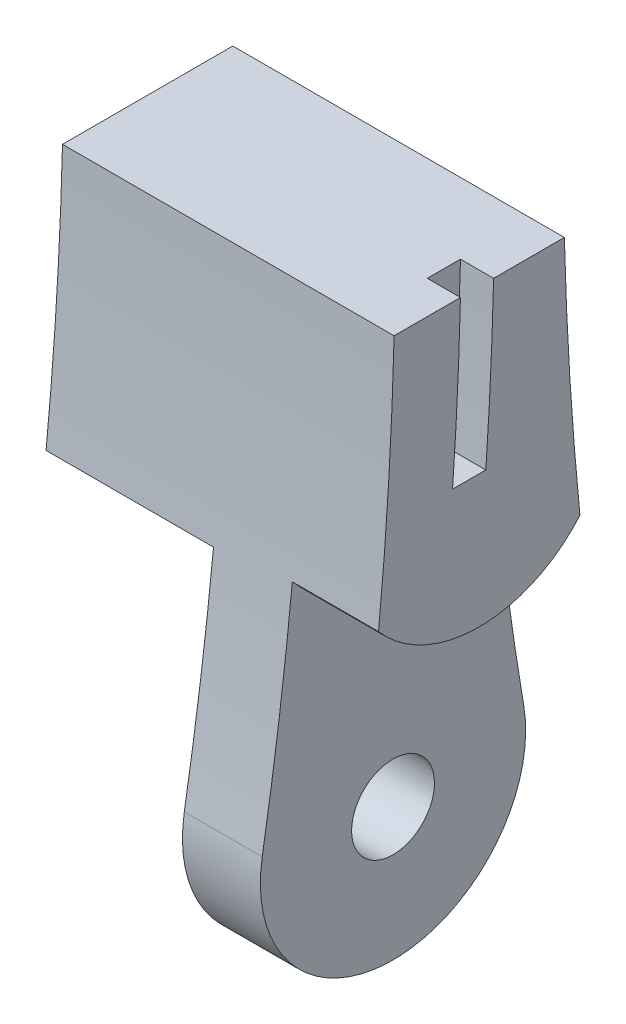
ISO-10303-21;
HEADER;
FILE_DESCRIPTION(('STEP AP214'),'2;1');
FILE_NAME('part.step','',(''),(''),'','','');
FILE_SCHEMA(('AUTOMOTIVE_DESIGN { 1 0 10303 214 1 1 1 1 }'));
ENDSEC;
DATA;
#1=APPLICATION_CONTEXT('core data for automotive mechanical design processes');
#2=APPLICATION_PROTOCOL_DEFINITION('international standard','automotive_design',2000,#1);
#3=PRODUCT_CONTEXT('',#1,'mechanical');
#4=PRODUCT('Part','Part','',(#3));
#5=PRODUCT_RELATED_PRODUCT_CATEGORY('part','',(#4));
#6=PRODUCT_DEFINITION_FORMATION('','',#4);
#7=PRODUCT_DEFINITION_CONTEXT('part definition',#1,'design');
#8=PRODUCT_DEFINITION('design','',#6,#7);
#9=PRODUCT_DEFINITION_SHAPE('','',#8);
#10=(LENGTH_UNIT() NAMED_UNIT(*) SI_UNIT(.MILLI.,.METRE.));
#11=(NAMED_UNIT(*) PLANE_ANGLE_UNIT() SI_UNIT($,.RADIAN.));
#12=(NAMED_UNIT(*) SI_UNIT($,.STERADIAN.) SOLID_ANGLE_UNIT());
#13=UNCERTAINTY_MEASURE_WITH_UNIT(LENGTH_MEASURE(1.E-05),#10,'distance_accuracy_value','');
#14=(GEOMETRIC_REPRESENTATION_CONTEXT(3) GLOBAL_UNCERTAINTY_ASSIGNED_CONTEXT((#13)) GLOBAL_UNIT_ASSIGNED_CONTEXT((#10,
#11,#12)) REPRESENTATION_CONTEXT('',''));
#15=CARTESIAN_POINT('',(0.,0.,0.));
#16=DIRECTION('',(0.,0.,1.));
#17=DIRECTION('',(1.,0.,0.));
#18=AXIS2_PLACEMENT_3D('',#15,#16,#17);
#19=CARTESIAN_POINT('',(20.,-57.7298826777088,0.));
#20=DIRECTION('',(-1.,0.,0.));
#21=DIRECTION('',(0.,0.,1.));
#22=AXIS2_PLACEMENT_3D('',#19,#20,#21);
#23=CYLINDRICAL_SURFACE('',#22,2.5);
#24=CARTESIAN_POINT('',(8.1,-57.7298826777088,0.));
#25=DIRECTION('',(-1.,0.,0.));
#26=DIRECTION('',(0.,0.,1.));
#27=AXIS2_PLACEMENT_3D('',#24,#25,#26);
#28=CIRCLE('',#27,2.5);
#29=CARTESIAN_POINT('',(8.1,-57.7298826777088,2.5));
#30=VERTEX_POINT('',#29);
#31=EDGE_CURVE('E189',#30,#30,#28,.T.);
#32=ORIENTED_EDGE('',*,*,#31,.T.);
#33=EDGE_LOOP('',(#32));
#34=FACE_BOUND('',#33,.T.);
#35=CARTESIAN_POINT('',(14.8,-57.7298826777088,0.));
#36=DIRECTION('',(1.,0.,0.));
#37=DIRECTION('',(0.,0.,-1.));
#38=AXIS2_PLACEMENT_3D('',#35,#36,#37);
#39=CIRCLE('',#38,2.5);
#40=CARTESIAN_POINT('',(14.8,-57.7298826777088,-2.5));
#41=VERTEX_POINT('',#40);
#42=EDGE_CURVE('E199',#41,#41,#39,.T.);
#43=ORIENTED_EDGE('',*,*,#42,.T.);
#44=EDGE_LOOP('',(#43));
#45=FACE_BOUND('',#44,.T.);
#46=ADVANCED_FACE('F34',(#34,#45),#23,.F.);
#47=CARTESIAN_POINT('',(-40.6180069084204,-57.7298826777088,0.));
#48=DIRECTION('',(1.,0.,0.));
#49=DIRECTION('',(0.,0.,-1.));
#50=AXIS2_PLACEMENT_3D('',#47,#48,#49);
#51=CYLINDRICAL_SURFACE('',#50,5.15);
#52=DIRECTION('',(1.,0.,0.));
#53=VECTOR('',#52,1.);
#54=CARTESIAN_POINT('',(-40.6180069084204,-53.2273833717677,-2.5));
#55=LINE('',#54,#53);
#56=CARTESIAN_POINT('',(8.1,-53.2273833717677,-2.5));
#57=VERTEX_POINT('',#56);
#58=CARTESIAN_POINT('',(10.1,-53.2273833717677,-2.5));
#59=VERTEX_POINT('',#58);
#60=EDGE_CURVE('E249',#57,#59,#55,.T.);
#61=ORIENTED_EDGE('',*,*,#60,.T.);
#62=CARTESIAN_POINT('',(10.1,-57.7298826777088,0.));
#63=DIRECTION('',(1.,0.,0.));
#64=DIRECTION('',(0.,0.,1.));
#65=AXIS2_PLACEMENT_3D('',#62,#63,#64);
#66=CIRCLE('',#65,5.15);
#67=CARTESIAN_POINT('',(10.1,-53.2273833717677,2.5));
#68=VERTEX_POINT('',#67);
#69=EDGE_CURVE('E274',#68,#59,#66,.T.);
#70=ORIENTED_EDGE('',*,*,#69,.F.);
#71=DIRECTION('',(1.,0.,0.));
#72=VECTOR('',#71,1.);
#73=CARTESIAN_POINT('',(-40.6180069084204,-53.2273833717677,2.5));
#74=LINE('',#73,#72);
#75=CARTESIAN_POINT('',(8.1,-53.2273833717677,2.5));
#76=VERTEX_POINT('',#75);
#77=EDGE_CURVE('E252',#76,#68,#74,.T.);
#78=ORIENTED_EDGE('',*,*,#77,.F.);
#79=CARTESIAN_POINT('',(8.1,-57.7298826777088,0.));
#80=DIRECTION('',(-1.,0.,0.));
#81=DIRECTION('',(0.,0.,1.));
#82=AXIS2_PLACEMENT_3D('',#79,#80,#81);
#83=CIRCLE('',#82,5.15);
#84=EDGE_CURVE('E206',#57,#76,#83,.T.);
#85=ORIENTED_EDGE('',*,*,#84,.F.);
#86=EDGE_LOOP('',(#61,#70,#78,#85));
#87=FACE_BOUND('',#86,.T.);
#88=ADVANCED_FACE('F329',(#87),#51,.T.);
#89=CARTESIAN_POINT('',(-40.6180069084204,-53.2273833717677,2.5));
#90=DIRECTION('',(0.,0.,1.));
#91=DIRECTION('',(0.,-1.,0.));
#92=AXIS2_PLACEMENT_3D('',#89,#90,#91);
#93=PLANE('',#92);
#94=ORIENTED_EDGE('',*,*,#77,.T.);
#95=DIRECTION('',(0.,-1.,0.));
#96=VECTOR('',#95,1.);
#97=CARTESIAN_POINT('',(10.1,-53.2273833717677,2.5));
#98=LINE('',#97,#96);
#99=CARTESIAN_POINT('',(10.1,-45.7298826777088,2.5));
#100=VERTEX_POINT('',#99);
#101=EDGE_CURVE('E277',#100,#68,#98,.T.);
#102=ORIENTED_EDGE('',*,*,#101,.F.);
#103=DIRECTION('',(1.,0.,0.));
#104=VECTOR('',#103,1.);
#105=CARTESIAN_POINT('',(-40.6180069084204,-45.7298826777088,2.5));
#106=LINE('',#105,#104);
#107=CARTESIAN_POINT('',(8.1,-45.7298826777088,2.5));
#108=VERTEX_POINT('',#107);
#109=EDGE_CURVE('E260',#108,#100,#106,.T.);
#110=ORIENTED_EDGE('',*,*,#109,.F.);
#111=DIRECTION('',(0.,1.,0.));
#112=VECTOR('',#111,1.);
#113=CARTESIAN_POINT('',(8.1,-65.7298826777088,2.5));
#114=LINE('',#113,#112);
#115=EDGE_CURVE('E196',#76,#108,#114,.T.);
#116=ORIENTED_EDGE('',*,*,#115,.F.);
#117=EDGE_LOOP('',(#94,#102,#110,#116));
#118=FACE_BOUND('',#117,.T.);
#119=ADVANCED_FACE('F333',(#118),#93,.T.);
#120=CARTESIAN_POINT('',(8.1,-65.7298826777088,20.));
#121=DIRECTION('',(-1.,0.,0.));
#122=DIRECTION('',(0.,0.,1.));
#123=AXIS2_PLACEMENT_3D('',#120,#121,#122);
#124=PLANE('',#123);
#125=ORIENTED_EDGE('',*,*,#31,.F.);
#126=EDGE_LOOP('',(#125));
#127=FACE_BOUND('',#126,.T.);
#128=DIRECTION('',(0.,0.,-1.));
#129=VECTOR('',#128,1.);
#130=CARTESIAN_POINT('',(8.1,-45.7298826777088,20.));
#131=LINE('',#130,#129);
#132=CARTESIAN_POINT('',(8.1,-45.7298826777088,-2.5));
#133=VERTEX_POINT('',#132);
#134=EDGE_CURVE('E186',#108,#133,#131,.T.);
#135=ORIENTED_EDGE('',*,*,#134,.T.);
#136=DIRECTION('',(0.,-1.,0.));
#137=VECTOR('',#136,1.);
#138=CARTESIAN_POINT('',(8.1,-65.7298826777088,-2.5));
#139=LINE('',#138,#137);
#140=EDGE_CURVE('E209',#133,#57,#139,.T.);
#141=ORIENTED_EDGE('',*,*,#140,.T.);
#142=ORIENTED_EDGE('',*,*,#84,.T.);
#143=ORIENTED_EDGE('',*,*,#115,.T.);
#144=EDGE_LOOP('',(#135,#141,#142,#143));
#145=FACE_BOUND('',#144,.T.);
#146=ADVANCED_FACE('F243',(#127,#145),#124,.T.);
#147=CARTESIAN_POINT('',(-40.6180069084204,-53.2273833717677,-2.5));
#148=DIRECTION('',(0.,0.,-1.));
#149=DIRECTION('',(0.,1.,0.));
#150=AXIS2_PLACEMENT_3D('',#147,#148,#149);
#151=PLANE('',#150);
#152=DIRECTION('',(1.,0.,0.));
#153=VECTOR('',#152,1.);
#154=CARTESIAN_POINT('',(-40.6180069084204,-45.7298826777088,-2.5));
#155=LINE('',#154,#153);
#156=CARTESIAN_POINT('',(10.1,-45.7298826777088,-2.5));
#157=VERTEX_POINT('',#156);
#158=EDGE_CURVE('E250',#133,#157,#155,.T.);
#159=ORIENTED_EDGE('',*,*,#158,.T.);
#160=DIRECTION('',(0.,1.,0.));
#161=VECTOR('',#160,1.);
#162=CARTESIAN_POINT('',(10.1,-53.2273833717677,-2.5));
#163=LINE('',#162,#161);
#164=EDGE_CURVE('E254',#59,#157,#163,.T.);
#165=ORIENTED_EDGE('',*,*,#164,.F.);
#166=ORIENTED_EDGE('',*,*,#60,.F.);
#167=ORIENTED_EDGE('',*,*,#140,.F.);
#168=EDGE_LOOP('',(#159,#165,#166,#167));
#169=FACE_BOUND('',#168,.T.);
#170=ADVANCED_FACE('F327',(#169),#151,.T.);
#171=CARTESIAN_POINT('',(-10.4655300205067,-37.7298826777088,0.));
#172=DIRECTION('',(1.,0.,0.));
#173=DIRECTION('',(0.,0.,-1.));
#174=AXIS2_PLACEMENT_3D('',#171,#172,#173);
#175=CYLINDRICAL_SURFACE('',#174,7.99999999999999);
#176=CARTESIAN_POINT('',(14.8,-37.7298826777088,0.));
#177=DIRECTION('',(1.,0.,0.));
#178=DIRECTION('',(0.,0.,-1.));
#179=AXIS2_PLACEMENT_3D('',#176,#177,#178);
#180=CIRCLE('',#179,7.99999999999999);
#181=CARTESIAN_POINT('',(14.8,-42.9372483872719,6.07316576151726));
#182=VERTEX_POINT('',#181);
#183=CARTESIAN_POINT('',(14.8,-42.9372483872719,-6.07316576151726));
#184=VERTEX_POINT('',#183);
#185=EDGE_CURVE('E307',#182,#184,#180,.T.);
#186=ORIENTED_EDGE('',*,*,#185,.T.);
#187=DIRECTION('',(1.,0.,0.));
#188=VECTOR('',#187,1.);
#189=CARTESIAN_POINT('',(17.4,-42.9372483872721,-6.0731657615171));
#190=LINE('',#189,#188);
#191=CARTESIAN_POINT('',(20.,-42.9372483872721,-6.0731657615171));
#192=VERTEX_POINT('',#191);
#193=EDGE_CURVE('E304',#192,#184,#190,.F.);
#194=ORIENTED_EDGE('',*,*,#193,.F.);
#195=CARTESIAN_POINT('',(20.,-37.7298826777088,0.));
#196=DIRECTION('',(-1.,0.,0.));
#197=DIRECTION('',(0.,0.,-1.));
#198=AXIS2_PLACEMENT_3D('',#195,#196,#197);
#199=CIRCLE('',#198,7.99999999999999);
#200=CARTESIAN_POINT('',(20.,-42.9372483872721,6.0731657615171));
#201=VERTEX_POINT('',#200);
#202=EDGE_CURVE('E308',#192,#201,#199,.T.);
#203=ORIENTED_EDGE('',*,*,#202,.T.);
#204=DIRECTION('',(1.,0.,0.));
#205=VECTOR('',#204,1.);
#206=CARTESIAN_POINT('',(17.4,-42.9372483872721,6.0731657615171));
#207=LINE('',#206,#205);
#208=EDGE_CURVE('E175',#182,#201,#207,.T.);
#209=ORIENTED_EDGE('',*,*,#208,.F.);
#210=EDGE_LOOP('',(#186,#194,#203,#209));
#211=FACE_BOUND('',#210,.T.);
#212=ADVANCED_FACE('F365',(#211),#175,.T.);
#213=CARTESIAN_POINT('',(14.8,-65.7298826777088,20.));
#214=DIRECTION('',(1.,0.,0.));
#215=DIRECTION('',(0.,0.,-1.));
#216=AXIS2_PLACEMENT_3D('',#213,#214,#215);
#217=PLANE('',#216);
#218=CARTESIAN_POINT('',(14.8,-22.9548826777087,-205.072424706492));
#219=DIRECTION('',(1.,0.,0.));
#220=DIRECTION('',(0.,0.,-1.));
#221=AXIS2_PLACEMENT_3D('',#218,#219,#220);
#222=CIRCLE('',#221,200.);
#223=CARTESIAN_POINT('',(14.8,-56.3923826777087,-7.8874009502497));
#224=VERTEX_POINT('',#223);
#225=EDGE_CURVE('E202',#224,#184,#222,.F.);
#226=ORIENTED_EDGE('',*,*,#225,.T.);
#227=ORIENTED_EDGE('',*,*,#185,.F.);
#228=CARTESIAN_POINT('',(14.8,-22.9548826777087,205.072424706492));
#229=DIRECTION('',(1.,0.,0.));
#230=DIRECTION('',(0.,0.,-1.));
#231=AXIS2_PLACEMENT_3D('',#228,#229,#230);
#232=CIRCLE('',#231,200.);
#233=CARTESIAN_POINT('',(14.8,-56.3923826777088,7.88740095024971));
#234=VERTEX_POINT('',#233);
#235=EDGE_CURVE('E231',#182,#234,#232,.F.);
#236=ORIENTED_EDGE('',*,*,#235,.T.);
#237=CARTESIAN_POINT('',(14.8,-57.7298826777088,0.));
#238=DIRECTION('',(1.,0.,0.));
#239=DIRECTION('',(0.,0.,-1.));
#240=AXIS2_PLACEMENT_3D('',#237,#238,#239);
#241=CIRCLE('',#240,8.);
#242=EDGE_CURVE('E228',#234,#224,#241,.T.);
#243=ORIENTED_EDGE('',*,*,#242,.T.);
#244=EDGE_LOOP('',(#226,#227,#236,#243));
#245=FACE_BOUND('',#244,.T.);
#246=ORIENTED_EDGE('',*,*,#42,.F.);
#247=EDGE_LOOP('',(#246));
#248=FACE_BOUND('',#247,.T.);
#249=ADVANCED_FACE('F359',(#245,#248),#217,.T.);
#250=CARTESIAN_POINT('',(20.,-57.7298826777088,0.));
#251=DIRECTION('',(-1.,0.,0.));
#252=DIRECTION('',(0.,0.,1.));
#253=AXIS2_PLACEMENT_3D('',#250,#251,#252);
#254=CYLINDRICAL_SURFACE('',#253,8.);
#255=CARTESIAN_POINT('',(10.1,-57.7298826777088,0.));
#256=DIRECTION('',(-1.,0.,0.));
#257=DIRECTION('',(0.,0.,1.));
#258=AXIS2_PLACEMENT_3D('',#255,#256,#257);
#259=CIRCLE('',#258,8.);
#260=CARTESIAN_POINT('',(10.1,-56.3923826777087,-7.8874009502497));
#261=VERTEX_POINT('',#260);
#262=CARTESIAN_POINT('',(10.1,-56.3923826777088,7.88740095024971));
#263=VERTEX_POINT('',#262);
#264=EDGE_CURVE('E42',#261,#263,#259,.T.);
#265=ORIENTED_EDGE('',*,*,#264,.F.);
#266=DIRECTION('',(-1.,0.,0.));
#267=VECTOR('',#266,1.);
#268=CARTESIAN_POINT('',(20.,-56.3923826777087,-7.8874009502497));
#269=LINE('',#268,#267);
#270=EDGE_CURVE('E180',#224,#261,#269,.T.);
#271=ORIENTED_EDGE('',*,*,#270,.F.);
#272=ORIENTED_EDGE('',*,*,#242,.F.);
#273=DIRECTION('',(-1.,0.,0.));
#274=VECTOR('',#273,1.);
#275=CARTESIAN_POINT('',(20.,-56.3923826777088,7.88740095024971));
#276=LINE('',#275,#274);
#277=EDGE_CURVE('E193',#234,#263,#276,.T.);
#278=ORIENTED_EDGE('',*,*,#277,.T.);
#279=EDGE_LOOP('',(#265,#271,#272,#278));
#280=FACE_BOUND('',#279,.T.);
#281=ADVANCED_FACE('F227',(#280),#254,.T.);
#282=CARTESIAN_POINT('',(10.1,-37.7298826777088,0.));
#283=DIRECTION('',(-1.,0.,0.));
#284=DIRECTION('',(0.,0.,1.));
#285=AXIS2_PLACEMENT_3D('',#282,#283,#284);
#286=PLANE('',#285);
#287=CARTESIAN_POINT('',(10.1,-22.9548826777087,205.072424706492));
#288=DIRECTION('',(-1.,0.,0.));
#289=DIRECTION('',(0.,0.,1.));
#290=AXIS2_PLACEMENT_3D('',#287,#288,#289);
#291=CIRCLE('',#290,200.);
#292=CARTESIAN_POINT('',(10.1,-43.4508425723786,6.12540756877284));
#293=VERTEX_POINT('',#292);
#294=EDGE_CURVE('E203',#263,#293,#291,.F.);
#295=ORIENTED_EDGE('',*,*,#294,.T.);
#296=CARTESIAN_POINT('',(10.1,-37.7298826777088,0.));
#297=DIRECTION('',(1.,0.,0.));
#298=DIRECTION('',(0.,0.,1.));
#299=AXIS2_PLACEMENT_3D('',#296,#297,#298);
#300=CIRCLE('',#299,8.3815273071201);
#301=EDGE_CURVE('E268',#293,#100,#300,.T.);
#302=ORIENTED_EDGE('',*,*,#301,.T.);
#303=ORIENTED_EDGE('',*,*,#101,.T.);
#304=ORIENTED_EDGE('',*,*,#69,.T.);
#305=ORIENTED_EDGE('',*,*,#164,.T.);
#306=CARTESIAN_POINT('',(10.1,-37.7298826777088,0.));
#307=DIRECTION('',(1.,0.,0.));
#308=DIRECTION('',(0.,0.,1.));
#309=AXIS2_PLACEMENT_3D('',#306,#307,#308);
#310=CIRCLE('',#309,8.3815273071201);
#311=CARTESIAN_POINT('',(10.1,-43.4508425723786,-6.12540756877284));
#312=VERTEX_POINT('',#311);
#313=EDGE_CURVE('E281',#157,#312,#310,.T.);
#314=ORIENTED_EDGE('',*,*,#313,.T.);
#315=CARTESIAN_POINT('',(10.1,-22.9548826777087,-205.072424706492));
#316=DIRECTION('',(-1.,0.,0.));
#317=DIRECTION('',(0.,0.,1.));
#318=AXIS2_PLACEMENT_3D('',#315,#316,#317);
#319=CIRCLE('',#318,200.);
#320=EDGE_CURVE('E218',#312,#261,#319,.F.);
#321=ORIENTED_EDGE('',*,*,#320,.T.);
#322=ORIENTED_EDGE('',*,*,#264,.T.);
#323=EDGE_LOOP('',(#295,#302,#303,#304,#305,#314,#321,#322));
#324=FACE_BOUND('',#323,.T.);
#325=ADVANCED_FACE('F214',(#324),#286,.T.);
#326=CARTESIAN_POINT('',(-40.6180069084204,-37.7298826777088,0.));
#327=DIRECTION('',(1.,0.,0.));
#328=DIRECTION('',(0.,0.,-1.));
#329=AXIS2_PLACEMENT_3D('',#326,#327,#328);
#330=CYLINDRICAL_SURFACE('',#329,8.3815273071201);
#331=DIRECTION('',(1.,0.,0.));
#332=VECTOR('',#331,1.);
#333=CARTESIAN_POINT('',(5.05,-43.4508425723783,6.12540756877311));
#334=LINE('',#333,#332);
#335=CARTESIAN_POINT('',(0.,-43.4508425723783,6.12540756877311));
#336=VERTEX_POINT('',#335);
#337=EDGE_CURVE('E224',#293,#336,#334,.F.);
#338=ORIENTED_EDGE('',*,*,#337,.T.);
#339=CARTESIAN_POINT('',(0.,-37.7298826777088,0.));
#340=DIRECTION('',(1.,0.,0.));
#341=DIRECTION('',(0.,0.,-1.));
#342=AXIS2_PLACEMENT_3D('',#339,#340,#341);
#343=CIRCLE('',#342,8.3815273071201);
#344=CARTESIAN_POINT('',(0.,-45.7298826777088,2.5));
#345=VERTEX_POINT('',#344);
#346=EDGE_CURVE('E262',#345,#336,#343,.F.);
#347=ORIENTED_EDGE('',*,*,#346,.F.);
#348=EDGE_CURVE('E56',#345,#108,#106,.T.);
#349=ORIENTED_EDGE('',*,*,#348,.T.);
#350=ORIENTED_EDGE('',*,*,#109,.T.);
#351=ORIENTED_EDGE('',*,*,#301,.F.);
#352=EDGE_LOOP('',(#338,#347,#349,#350,#351));
#353=FACE_BOUND('',#352,.T.);
#354=ADVANCED_FACE('F267',(#353),#330,.T.);
#355=CARTESIAN_POINT('',(0.,-45.7298826777088,20.));
#356=DIRECTION('',(0.,-1.,0.));
#357=DIRECTION('',(0.,0.,-1.));
#358=AXIS2_PLACEMENT_3D('',#355,#356,#357);
#359=PLANE('',#358);
#360=ORIENTED_EDGE('',*,*,#134,.F.);
#361=ORIENTED_EDGE('',*,*,#348,.F.);
#362=DIRECTION('',(0.,0.,-1.));
#363=VECTOR('',#362,1.);
#364=CARTESIAN_POINT('',(0.,-45.7298826777088,20.));
#365=LINE('',#364,#363);
#366=CARTESIAN_POINT('',(0.,-45.7298826777088,-2.5));
#367=VERTEX_POINT('',#366);
#368=EDGE_CURVE('E233',#345,#367,#365,.T.);
#369=ORIENTED_EDGE('',*,*,#368,.T.);
#370=EDGE_CURVE('E245',#367,#133,#155,.T.);
#371=ORIENTED_EDGE('',*,*,#370,.T.);
#372=EDGE_LOOP('',(#360,#361,#369,#371));
#373=FACE_BOUND('',#372,.T.);
#374=ADVANCED_FACE('F244',(#373),#359,.T.);
#375=CARTESIAN_POINT('',(-40.6180069084204,-37.7298826777088,0.));
#376=DIRECTION('',(1.,0.,0.));
#377=DIRECTION('',(0.,0.,-1.));
#378=AXIS2_PLACEMENT_3D('',#375,#376,#377);
#379=CYLINDRICAL_SURFACE('',#378,8.3815273071201);
#380=DIRECTION('',(1.,0.,0.));
#381=VECTOR('',#380,1.);
#382=CARTESIAN_POINT('',(5.05,-43.4508425723783,-6.1254075687731));
#383=LINE('',#382,#381);
#384=CARTESIAN_POINT('',(0.,-43.4508425723783,-6.1254075687731));
#385=VERTEX_POINT('',#384);
#386=EDGE_CURVE('E263',#385,#312,#383,.T.);
#387=ORIENTED_EDGE('',*,*,#386,.T.);
#388=ORIENTED_EDGE('',*,*,#313,.F.);
#389=ORIENTED_EDGE('',*,*,#158,.F.);
#390=ORIENTED_EDGE('',*,*,#370,.F.);
#391=CARTESIAN_POINT('',(0.,-37.7298826777088,0.));
#392=DIRECTION('',(1.,0.,0.));
#393=DIRECTION('',(0.,0.,-1.));
#394=AXIS2_PLACEMENT_3D('',#391,#392,#393);
#395=CIRCLE('',#394,8.3815273071201);
#396=EDGE_CURVE('E256',#385,#367,#395,.F.);
#397=ORIENTED_EDGE('',*,*,#396,.F.);
#398=EDGE_LOOP('',(#387,#388,#389,#390,#397));
#399=FACE_BOUND('',#398,.T.);
#400=ADVANCED_FACE('F322',(#399),#379,.T.);
#401=CARTESIAN_POINT('',(18.,-37.7299537414532,1.608183929246));
#402=DIRECTION('',(0.,-1.,0.));
#403=DIRECTION('',(0.,0.,-1.));
#404=AXIS2_PLACEMENT_3D('',#401,#402,#403);
#405=PLANE('',#404);
#406=DIRECTION('',(0.,0.,-1.));
#407=VECTOR('',#406,1.);
#408=CARTESIAN_POINT('',(20.,-37.7299537414532,1.608183929246));
#409=LINE('',#408,#407);
#410=CARTESIAN_POINT('',(20.,-37.7299537414532,1.608183929246));
#411=VERTEX_POINT('',#410);
#412=CARTESIAN_POINT('',(20.,-37.7299537414532,-0.397031113737234));
#413=VERTEX_POINT('',#412);
#414=EDGE_CURVE('E293',#411,#413,#409,.T.);
#415=ORIENTED_EDGE('',*,*,#414,.T.);
#416=DIRECTION('',(1.,0.,0.));
#417=VECTOR('',#416,1.);
#418=CARTESIAN_POINT('',(18.,-37.7299537414532,-0.397031113737234));
#419=LINE('',#418,#417);
#420=CARTESIAN_POINT('',(18.,-37.7299537414532,-0.397031113737234));
#421=VERTEX_POINT('',#420);
#422=EDGE_CURVE('E283',#421,#413,#419,.T.);
#423=ORIENTED_EDGE('',*,*,#422,.F.);
#424=DIRECTION('',(0.,0.,-1.));
#425=VECTOR('',#424,1.);
#426=CARTESIAN_POINT('',(18.,-37.7299537414532,1.608183929246));
#427=LINE('',#426,#425);
#428=CARTESIAN_POINT('',(18.,-37.7299537414532,1.608183929246));
#429=VERTEX_POINT('',#428);
#430=EDGE_CURVE('E299',#429,#421,#427,.T.);
#431=ORIENTED_EDGE('',*,*,#430,.F.);
#432=DIRECTION('',(1.,0.,0.));
#433=VECTOR('',#432,1.);
#434=CARTESIAN_POINT('',(18.,-37.7299537414532,1.608183929246));
#435=LINE('',#434,#433);
#436=EDGE_CURVE('E284',#429,#411,#435,.T.);
#437=ORIENTED_EDGE('',*,*,#436,.T.);
#438=EDGE_LOOP('',(#415,#423,#431,#437));
#439=FACE_BOUND('',#438,.T.);
#440=ADVANCED_FACE('F379',(#439),#405,.F.);
#441=CARTESIAN_POINT('',(18.,-22.9548826777087,205.072424706492));
#442=DIRECTION('',(1.,0.,0.));
#443=DIRECTION('',(0.,0.,-1.));
#444=AXIS2_PLACEMENT_3D('',#441,#442,#443);
#445=CYLINDRICAL_SURFACE('',#444,206.);
#446=CARTESIAN_POINT('',(20.,-22.9548826777087,205.072424706492));
#447=DIRECTION('',(1.,0.,0.));
#448=DIRECTION('',(0.,0.,-1.));
#449=AXIS2_PLACEMENT_3D('',#446,#447,#448);
#450=CIRCLE('',#449,206.);
#451=CARTESIAN_POINT('',(20.,-27.9548826777087,-0.866886742293405));
#452=VERTEX_POINT('',#451);
#453=EDGE_CURVE('E289',#413,#452,#450,.T.);
#454=ORIENTED_EDGE('',*,*,#453,.T.);
#455=DIRECTION('',(1.,0.,0.));
#456=VECTOR('',#455,1.);
#457=CARTESIAN_POINT('',(18.,-27.9548826777087,-0.866886742293405));
#458=LINE('',#457,#456);
#459=CARTESIAN_POINT('',(18.,-27.9548826777087,-0.866886742293405));
#460=VERTEX_POINT('',#459);
#461=EDGE_CURVE('E11',#452,#460,#458,.F.);
#462=ORIENTED_EDGE('',*,*,#461,.T.);
#463=CARTESIAN_POINT('',(18.,-22.9548826777087,205.072424706492));
#464=DIRECTION('',(1.,0.,0.));
#465=DIRECTION('',(0.,0.,-1.));
#466=AXIS2_PLACEMENT_3D('',#463,#464,#465);
#467=CIRCLE('',#466,206.);
#468=EDGE_CURVE('E287',#421,#460,#467,.T.);
#469=ORIENTED_EDGE('',*,*,#468,.F.);
#470=ORIENTED_EDGE('',*,*,#422,.T.);
#471=EDGE_LOOP('',(#454,#462,#469,#470));
#472=FACE_BOUND('',#471,.T.);
#473=ADVANCED_FACE('F485',(#472),#445,.F.);
#474=CARTESIAN_POINT('',(18.,-22.9548826777087,205.072424706492));
#475=DIRECTION('',(1.,0.,0.));
#476=DIRECTION('',(0.,0.,-1.));
#477=AXIS2_PLACEMENT_3D('',#474,#475,#476);
#478=CYLINDRICAL_SURFACE('',#477,204.);
#479=CARTESIAN_POINT('',(18.,-22.9548826777087,205.072424706492));
#480=DIRECTION('',(-1.,0.,0.));
#481=DIRECTION('',(0.,0.,-1.));
#482=AXIS2_PLACEMENT_3D('',#479,#480,#481);
#483=CIRCLE('',#482,204.);
#484=CARTESIAN_POINT('',(18.,-27.9548826777087,1.13370842142801));
#485=VERTEX_POINT('',#484);
#486=EDGE_CURVE('E292',#485,#429,#483,.T.);
#487=ORIENTED_EDGE('',*,*,#486,.F.);
#488=DIRECTION('',(1.,0.,0.));
#489=VECTOR('',#488,1.);
#490=CARTESIAN_POINT('',(18.,-27.9548826777087,1.13370842142801));
#491=LINE('',#490,#489);
#492=CARTESIAN_POINT('',(20.,-27.9548826777087,1.13370842142801));
#493=VERTEX_POINT('',#492);
#494=EDGE_CURVE('E162',#485,#493,#491,.T.);
#495=ORIENTED_EDGE('',*,*,#494,.T.);
#496=CARTESIAN_POINT('',(20.,-22.9548826777087,205.072424706492));
#497=DIRECTION('',(-1.,0.,0.));
#498=DIRECTION('',(0.,0.,-1.));
#499=AXIS2_PLACEMENT_3D('',#496,#497,#498);
#500=CIRCLE('',#499,204.);
#501=EDGE_CURVE('E170',#493,#411,#500,.T.);
#502=ORIENTED_EDGE('',*,*,#501,.T.);
#503=ORIENTED_EDGE('',*,*,#436,.F.);
#504=EDGE_LOOP('',(#487,#495,#502,#503));
#505=FACE_BOUND('',#504,.T.);
#506=ADVANCED_FACE('F438',(#505),#478,.T.);
#507=CARTESIAN_POINT('',(18.,-22.9548826777087,205.072424706492));
#508=DIRECTION('',(1.,0.,0.));
#509=DIRECTION('',(0.,0.,-1.));
#510=AXIS2_PLACEMENT_3D('',#507,#508,#509);
#511=PLANE('',#510);
#512=DIRECTION('',(0.,0.,-1.));
#513=VECTOR('',#512,1.);
#514=CARTESIAN_POINT('',(18.,-27.9548826777087,205.072424706492));
#515=LINE('',#514,#513);
#516=EDGE_CURVE('E49',#485,#460,#515,.T.);
#517=ORIENTED_EDGE('',*,*,#516,.F.);
#518=ORIENTED_EDGE('',*,*,#486,.T.);
#519=ORIENTED_EDGE('',*,*,#430,.T.);
#520=ORIENTED_EDGE('',*,*,#468,.T.);
#521=EDGE_LOOP('',(#517,#518,#519,#520));
#522=FACE_BOUND('',#521,.T.);
#523=ADVANCED_FACE('F356',(#522),#511,.T.);
#524=CARTESIAN_POINT('',(0.,-0.342382677708759,102.536212353246));
#525=DIRECTION('',(1.,0.,0.));
#526=DIRECTION('',(0.,0.,-1.));
#527=AXIS2_PLACEMENT_3D('',#524,#525,#526);
#528=PLANE('',#527);
#529=CARTESIAN_POINT('',(0.,-22.9548826777087,205.072424706492));
#530=DIRECTION('',(-1.,0.,0.));
#531=DIRECTION('',(0.,0.,-1.));
#532=AXIS2_PLACEMENT_3D('',#529,#530,#531);
#533=CIRCLE('',#532,200.);
#534=CARTESIAN_POINT('',(0.,-27.9548826777087,5.13493447517035));
#535=VERTEX_POINT('',#534);
#536=EDGE_CURVE('E183',#535,#336,#533,.T.);
#537=ORIENTED_EDGE('',*,*,#536,.F.);
#538=DIRECTION('',(0.,0.,-1.));
#539=VECTOR('',#538,1.);
#540=CARTESIAN_POINT('',(0.,-27.9548826777087,9.30475326027994));
#541=LINE('',#540,#539);
#542=CARTESIAN_POINT('',(0.,-27.9548826777087,-5.13493447517035));
#543=VERTEX_POINT('',#542);
#544=EDGE_CURVE('E157',#535,#543,#541,.T.);
#545=ORIENTED_EDGE('',*,*,#544,.T.);
#546=CARTESIAN_POINT('',(0.,-22.9548826777087,-205.072424706492));
#547=DIRECTION('',(-1.,0.,0.));
#548=DIRECTION('',(0.,0.,-1.));
#549=AXIS2_PLACEMENT_3D('',#546,#547,#548);
#550=CIRCLE('',#549,200.);
#551=EDGE_CURVE('E177',#385,#543,#550,.T.);
#552=ORIENTED_EDGE('',*,*,#551,.F.);
#553=ORIENTED_EDGE('',*,*,#396,.T.);
#554=ORIENTED_EDGE('',*,*,#368,.F.);
#555=ORIENTED_EDGE('',*,*,#346,.T.);
#556=EDGE_LOOP('',(#537,#545,#552,#553,#554,#555));
#557=FACE_BOUND('',#556,.T.);
#558=ADVANCED_FACE('F270',(#557),#528,.F.);
#559=CARTESIAN_POINT('',(20.,-22.9548826777087,205.072424706492));
#560=DIRECTION('',(-1.,0.,0.));
#561=DIRECTION('',(0.,0.,1.));
#562=AXIS2_PLACEMENT_3D('',#559,#560,#561);
#563=CYLINDRICAL_SURFACE('',#562,200.);
#564=CARTESIAN_POINT('',(20.,-22.9548826777087,205.072424706492));
#565=DIRECTION('',(-1.,0.,0.));
#566=DIRECTION('',(0.,0.,-1.));
#567=AXIS2_PLACEMENT_3D('',#564,#565,#566);
#568=CIRCLE('',#567,200.);
#569=CARTESIAN_POINT('',(20.,-27.9548826777087,5.13493447517035));
#570=VERTEX_POINT('',#569);
#571=EDGE_CURVE('E167',#570,#201,#568,.T.);
#572=ORIENTED_EDGE('',*,*,#571,.F.);
#573=DIRECTION('',(-1.,0.,0.));
#574=VECTOR('',#573,1.);
#575=CARTESIAN_POINT('',(20.,-27.9548826777087,5.13493447517035));
#576=LINE('',#575,#574);
#577=EDGE_CURVE('E151',#570,#535,#576,.T.);
#578=ORIENTED_EDGE('',*,*,#577,.T.);
#579=ORIENTED_EDGE('',*,*,#536,.T.);
#580=ORIENTED_EDGE('',*,*,#337,.F.);
#581=ORIENTED_EDGE('',*,*,#294,.F.);
#582=ORIENTED_EDGE('',*,*,#277,.F.);
#583=ORIENTED_EDGE('',*,*,#235,.F.);
#584=ORIENTED_EDGE('',*,*,#208,.T.);
#585=EDGE_LOOP('',(#572,#578,#579,#580,#581,#582,#583,#584));
#586=FACE_BOUND('',#585,.T.);
#587=ADVANCED_FACE('F36',(#586),#563,.F.);
#588=CARTESIAN_POINT('',(20.,-0.342382677708759,102.536212353246));
#589=DIRECTION('',(1.,0.,0.));
#590=DIRECTION('',(0.,0.,-1.));
#591=AXIS2_PLACEMENT_3D('',#588,#589,#590);
#592=PLANE('',#591);
#593=DIRECTION('',(0.,0.,-1.));
#594=VECTOR('',#593,1.);
#595=CARTESIAN_POINT('',(20.,-27.9548826777087,9.30475326027994));
#596=LINE('',#595,#594);
#597=EDGE_CURVE('E154',#570,#493,#596,.T.);
#598=ORIENTED_EDGE('',*,*,#597,.F.);
#599=ORIENTED_EDGE('',*,*,#571,.T.);
#600=ORIENTED_EDGE('',*,*,#202,.F.);
#601=CARTESIAN_POINT('',(20.,-22.9548826777087,-205.072424706492));
#602=DIRECTION('',(-1.,0.,0.));
#603=DIRECTION('',(0.,0.,-1.));
#604=AXIS2_PLACEMENT_3D('',#601,#602,#603);
#605=CIRCLE('',#604,200.);
#606=CARTESIAN_POINT('',(20.,-27.9548826777087,-5.13493447517035));
#607=VERTEX_POINT('',#606);
#608=EDGE_CURVE('E176',#192,#607,#605,.T.);
#609=ORIENTED_EDGE('',*,*,#608,.T.);
#610=EDGE_CURVE('E171',#452,#607,#596,.T.);
#611=ORIENTED_EDGE('',*,*,#610,.F.);
#612=ORIENTED_EDGE('',*,*,#453,.F.);
#613=ORIENTED_EDGE('',*,*,#414,.F.);
#614=ORIENTED_EDGE('',*,*,#501,.F.);
#615=EDGE_LOOP('',(#598,#599,#600,#609,#611,#612,#613,#614));
#616=FACE_BOUND('',#615,.T.);
#617=ADVANCED_FACE('F166',(#616),#592,.T.);
#618=CARTESIAN_POINT('',(20.,-22.9548826777087,-205.072424706492));
#619=DIRECTION('',(-1.,0.,0.));
#620=DIRECTION('',(0.,0.,1.));
#621=AXIS2_PLACEMENT_3D('',#618,#619,#620);
#622=CYLINDRICAL_SURFACE('',#621,200.);
#623=ORIENTED_EDGE('',*,*,#551,.T.);
#624=DIRECTION('',(-1.,0.,0.));
#625=VECTOR('',#624,1.);
#626=CARTESIAN_POINT('',(20.,-27.9548826777087,-5.13493447517035));
#627=LINE('',#626,#625);
#628=EDGE_CURVE('E161',#543,#607,#627,.F.);
#629=ORIENTED_EDGE('',*,*,#628,.T.);
#630=ORIENTED_EDGE('',*,*,#608,.F.);
#631=ORIENTED_EDGE('',*,*,#193,.T.);
#632=ORIENTED_EDGE('',*,*,#225,.F.);
#633=ORIENTED_EDGE('',*,*,#270,.T.);
#634=ORIENTED_EDGE('',*,*,#320,.F.);
#635=ORIENTED_EDGE('',*,*,#386,.F.);
#636=EDGE_LOOP('',(#623,#629,#630,#631,#632,#633,#634,#635));
#637=FACE_BOUND('',#636,.T.);
#638=ADVANCED_FACE('F319',(#637),#622,.F.);
#639=CARTESIAN_POINT('',(0.,-27.9548826777087,9.30475326027994));
#640=DIRECTION('',(0.,-1.,0.));
#641=DIRECTION('',(0.,0.,-1.));
#642=AXIS2_PLACEMENT_3D('',#639,#640,#641);
#643=PLANE('',#642);
#644=ORIENTED_EDGE('',*,*,#544,.F.);
#645=ORIENTED_EDGE('',*,*,#577,.F.);
#646=ORIENTED_EDGE('',*,*,#597,.T.);
#647=ORIENTED_EDGE('',*,*,#494,.F.);
#648=ORIENTED_EDGE('',*,*,#516,.T.);
#649=ORIENTED_EDGE('',*,*,#461,.F.);
#650=ORIENTED_EDGE('',*,*,#610,.T.);
#651=ORIENTED_EDGE('',*,*,#628,.F.);
#652=EDGE_LOOP('',(#644,#645,#646,#647,#648,#649,#650,#651));
#653=FACE_BOUND('',#652,.T.);
#654=ADVANCED_FACE('F153',(#653),#643,.F.);
#655=CLOSED_SHELL('',(#46,#88,#119,#146,#170,#212,#249,#281,#325,#354,#374,#400,#440,#473,#506,
#523,#558,#587,#617,#638,#654));
#656=MANIFOLD_SOLID_BREP('B2',#655);
#657=ADVANCED_BREP_SHAPE_REPRESENTATION('',(#18,#656),#14);
#658=SHAPE_DEFINITION_REPRESENTATION(#9,#657);
ENDSEC;
END-ISO-10303-21;
